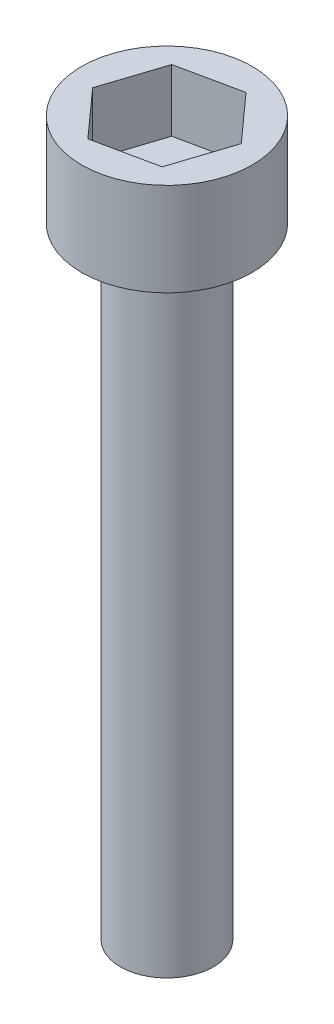
ISO-10303-21;
HEADER;
FILE_DESCRIPTION(('STEP AP214'),'2;1');
FILE_NAME('part.step','',(''),(''),'','','');
FILE_SCHEMA(('AUTOMOTIVE_DESIGN { 1 0 10303 214 1 1 1 1 }'));
ENDSEC;
DATA;
#1=APPLICATION_CONTEXT('core data for automotive mechanical design processes');
#2=APPLICATION_PROTOCOL_DEFINITION('international standard','automotive_design',2000,#1);
#3=PRODUCT_CONTEXT('',#1,'mechanical');
#4=PRODUCT('Part','Part','',(#3));
#5=PRODUCT_RELATED_PRODUCT_CATEGORY('part','',(#4));
#6=PRODUCT_DEFINITION_FORMATION('','',#4);
#7=PRODUCT_DEFINITION_CONTEXT('part definition',#1,'design');
#8=PRODUCT_DEFINITION('design','',#6,#7);
#9=PRODUCT_DEFINITION_SHAPE('','',#8);
#10=(LENGTH_UNIT() NAMED_UNIT(*) SI_UNIT(.MILLI.,.METRE.));
#11=(NAMED_UNIT(*) PLANE_ANGLE_UNIT() SI_UNIT($,.RADIAN.));
#12=(NAMED_UNIT(*) SI_UNIT($,.STERADIAN.) SOLID_ANGLE_UNIT());
#13=UNCERTAINTY_MEASURE_WITH_UNIT(LENGTH_MEASURE(1.E-05),#10,'distance_accuracy_value','');
#14=(GEOMETRIC_REPRESENTATION_CONTEXT(3) GLOBAL_UNCERTAINTY_ASSIGNED_CONTEXT((#13)) GLOBAL_UNIT_ASSIGNED_CONTEXT((#10,
#11,#12)) REPRESENTATION_CONTEXT('',''));
#15=CARTESIAN_POINT('',(0.,0.,0.));
#16=DIRECTION('',(0.,0.,1.));
#17=DIRECTION('',(1.,0.,0.));
#18=AXIS2_PLACEMENT_3D('',#15,#16,#17);
#19=CARTESIAN_POINT('',(0.,20.,0.));
#20=DIRECTION('',(0.,-1.,0.));
#21=DIRECTION('',(0.,0.,-1.));
#22=AXIS2_PLACEMENT_3D('',#19,#20,#21);
#23=CYLINDRICAL_SURFACE('',#22,1.5);
#24=CARTESIAN_POINT('',(0.,20.,0.));
#25=DIRECTION('',(0.,1.,0.));
#26=DIRECTION('',(0.,0.,1.));
#27=AXIS2_PLACEMENT_3D('',#24,#25,#26);
#28=CIRCLE('',#27,1.5);
#29=CARTESIAN_POINT('',(0.,20.,1.5));
#30=VERTEX_POINT('',#29);
#31=EDGE_CURVE('E11',#30,#30,#28,.T.);
#32=ORIENTED_EDGE('',*,*,#31,.F.);
#33=EDGE_LOOP('',(#32));
#34=FACE_BOUND('',#33,.T.);
#35=CARTESIAN_POINT('',(0.,0.,0.));
#36=DIRECTION('',(0.,1.,0.));
#37=DIRECTION('',(0.,0.,1.));
#38=AXIS2_PLACEMENT_3D('',#35,#36,#37);
#39=CIRCLE('',#38,1.5);
#40=CARTESIAN_POINT('',(0.,0.,1.5));
#41=VERTEX_POINT('',#40);
#42=EDGE_CURVE('E42',#41,#41,#39,.T.);
#43=ORIENTED_EDGE('',*,*,#42,.T.);
#44=EDGE_LOOP('',(#43));
#45=FACE_BOUND('',#44,.T.);
#46=ADVANCED_FACE('F39',(#34,#45),#23,.T.);
#47=CARTESIAN_POINT('',(0.,0.,0.));
#48=DIRECTION('',(0.,1.,0.));
#49=DIRECTION('',(0.,0.,1.));
#50=AXIS2_PLACEMENT_3D('',#47,#48,#49);
#51=PLANE('',#50);
#52=ORIENTED_EDGE('',*,*,#42,.F.);
#53=EDGE_LOOP('',(#52));
#54=FACE_BOUND('',#53,.T.);
#55=ADVANCED_FACE('F189',(#54),#51,.F.);
#56=CARTESIAN_POINT('',(0.,23.,0.));
#57=DIRECTION('',(0.,-1.,0.));
#58=DIRECTION('',(0.,0.,-1.));
#59=AXIS2_PLACEMENT_3D('',#56,#57,#58);
#60=CYLINDRICAL_SURFACE('',#59,2.75);
#61=CARTESIAN_POINT('',(0.,23.,0.));
#62=DIRECTION('',(0.,1.,0.));
#63=DIRECTION('',(0.,0.,1.));
#64=AXIS2_PLACEMENT_3D('',#61,#62,#63);
#65=CIRCLE('',#64,2.75);
#66=CARTESIAN_POINT('',(0.,23.,2.75));
#67=VERTEX_POINT('',#66);
#68=EDGE_CURVE('E163',#67,#67,#65,.T.);
#69=ORIENTED_EDGE('',*,*,#68,.F.);
#70=EDGE_LOOP('',(#69));
#71=FACE_BOUND('',#70,.T.);
#72=CARTESIAN_POINT('',(0.,20.,0.));
#73=DIRECTION('',(0.,1.,0.));
#74=DIRECTION('',(0.,0.,1.));
#75=AXIS2_PLACEMENT_3D('',#72,#73,#74);
#76=CIRCLE('',#75,2.75);
#77=CARTESIAN_POINT('',(0.,20.,2.75));
#78=VERTEX_POINT('',#77);
#79=EDGE_CURVE('E153',#78,#78,#76,.T.);
#80=ORIENTED_EDGE('',*,*,#79,.T.);
#81=EDGE_LOOP('',(#80));
#82=FACE_BOUND('',#81,.T.);
#83=ADVANCED_FACE('F171',(#71,#82),#60,.T.);
#84=CARTESIAN_POINT('',(0.,23.,0.));
#85=DIRECTION('',(0.,1.,0.));
#86=DIRECTION('',(0.,0.,1.));
#87=AXIS2_PLACEMENT_3D('',#84,#85,#86);
#88=PLANE('',#87);
#89=DIRECTION('',(0.310351345735064,0.,-0.950621923900577));
#90=VECTOR('',#89,1.);
#91=CARTESIAN_POINT('',(1.35002085906988,23.,1.50358804644409));
#92=LINE('',#91,#90);
#93=CARTESIAN_POINT('',(1.35002085906988,23.,1.50358804644409));
#94=VERTEX_POINT('',#93);
#95=CARTESIAN_POINT('',(1.97715587458214,23.,-0.417358336371365));
#96=VERTEX_POINT('',#95);
#97=EDGE_CURVE('E54',#94,#96,#92,.T.);
#98=ORIENTED_EDGE('',*,*,#97,.F.);
#99=DIRECTION('',(0.978438408359869,0.,-0.206538812445036));
#100=VECTOR('',#99,1.);
#101=CARTESIAN_POINT('',(-0.627135015512258,23.,1.92094638281546));
#102=LINE('',#101,#100);
#103=CARTESIAN_POINT('',(-0.627135015512258,23.,1.92094638281546));
#104=VERTEX_POINT('',#103);
#105=EDGE_CURVE('E147',#104,#94,#102,.T.);
#106=ORIENTED_EDGE('',*,*,#105,.F.);
#107=DIRECTION('',(0.668087062624805,0.,0.744083111455542));
#108=VECTOR('',#107,1.);
#109=CARTESIAN_POINT('',(-1.97715587458214,23.,0.417358336371365));
#110=LINE('',#109,#108);
#111=CARTESIAN_POINT('',(-1.97715587458214,23.,0.417358336371365));
#112=VERTEX_POINT('',#111);
#113=EDGE_CURVE('E144',#112,#104,#110,.T.);
#114=ORIENTED_EDGE('',*,*,#113,.F.);
#115=DIRECTION('',(-0.310351345735064,0.,0.950621923900577));
#116=VECTOR('',#115,1.);
#117=CARTESIAN_POINT('',(-1.35002085906988,23.,-1.50358804644409));
#118=LINE('',#117,#116);
#119=CARTESIAN_POINT('',(-1.35002085906988,23.,-1.50358804644409));
#120=VERTEX_POINT('',#119);
#121=EDGE_CURVE('E102',#120,#112,#118,.T.);
#122=ORIENTED_EDGE('',*,*,#121,.F.);
#123=DIRECTION('',(-0.978438408359869,0.,0.206538812445035));
#124=VECTOR('',#123,1.);
#125=CARTESIAN_POINT('',(0.627135015512258,23.,-1.92094638281546));
#126=LINE('',#125,#124);
#127=CARTESIAN_POINT('',(0.627135015512258,23.,-1.92094638281546));
#128=VERTEX_POINT('',#127);
#129=EDGE_CURVE('E138',#128,#120,#126,.T.);
#130=ORIENTED_EDGE('',*,*,#129,.F.);
#131=DIRECTION('',(-0.668087062624805,0.,-0.744083111455542));
#132=VECTOR('',#131,1.);
#133=CARTESIAN_POINT('',(1.97715587458214,23.,-0.417358336371365));
#134=LINE('',#133,#132);
#135=EDGE_CURVE('E134',#96,#128,#134,.T.);
#136=ORIENTED_EDGE('',*,*,#135,.F.);
#137=EDGE_LOOP('',(#98,#106,#114,#122,#130,#136));
#138=FACE_BOUND('',#137,.T.);
#139=ORIENTED_EDGE('',*,*,#68,.T.);
#140=EDGE_LOOP('',(#139));
#141=FACE_BOUND('',#140,.T.);
#142=ADVANCED_FACE('F176',(#138,#141),#88,.T.);
#143=CARTESIAN_POINT('',(0.,20.,0.));
#144=DIRECTION('',(0.,1.,0.));
#145=DIRECTION('',(0.,0.,1.));
#146=AXIS2_PLACEMENT_3D('',#143,#144,#145);
#147=PLANE('',#146);
#148=ORIENTED_EDGE('',*,*,#31,.T.);
#149=EDGE_LOOP('',(#148));
#150=FACE_BOUND('',#149,.T.);
#151=ORIENTED_EDGE('',*,*,#79,.F.);
#152=EDGE_LOOP('',(#151));
#153=FACE_BOUND('',#152,.T.);
#154=ADVANCED_FACE('F173',(#150,#153),#147,.F.);
#155=CARTESIAN_POINT('',(1.35002085906988,21.,1.50358804644409));
#156=DIRECTION('',(0.950621923900577,0.,0.310351345735064));
#157=DIRECTION('',(0.310351345735064,0.,-0.950621923900577));
#158=AXIS2_PLACEMENT_3D('',#155,#156,#157);
#159=PLANE('',#158);
#160=ORIENTED_EDGE('',*,*,#97,.T.);
#161=DIRECTION('',(0.,1.,0.));
#162=VECTOR('',#161,1.);
#163=CARTESIAN_POINT('',(1.97715587458214,21.,-0.417358336371365));
#164=LINE('',#163,#162);
#165=CARTESIAN_POINT('',(1.97715587458214,21.,-0.417358336371365));
#166=VERTEX_POINT('',#165);
#167=EDGE_CURVE('E84',#166,#96,#164,.T.);
#168=ORIENTED_EDGE('',*,*,#167,.F.);
#169=DIRECTION('',(0.310351345735064,0.,-0.950621923900577));
#170=VECTOR('',#169,1.);
#171=CARTESIAN_POINT('',(1.35002085906988,21.,1.50358804644409));
#172=LINE('',#171,#170);
#173=CARTESIAN_POINT('',(1.35002085906988,21.,1.50358804644409));
#174=VERTEX_POINT('',#173);
#175=EDGE_CURVE('E150',#174,#166,#172,.T.);
#176=ORIENTED_EDGE('',*,*,#175,.F.);
#177=DIRECTION('',(0.,1.,0.));
#178=VECTOR('',#177,1.);
#179=CARTESIAN_POINT('',(1.35002085906988,21.,1.50358804644409));
#180=LINE('',#179,#178);
#181=EDGE_CURVE('E62',#174,#94,#180,.T.);
#182=ORIENTED_EDGE('',*,*,#181,.T.);
#183=EDGE_LOOP('',(#160,#168,#176,#182));
#184=FACE_BOUND('',#183,.T.);
#185=ADVANCED_FACE('F175',(#184),#159,.F.);
#186=CARTESIAN_POINT('',(-0.627135015512258,21.,1.92094638281546));
#187=DIRECTION('',(0.206538812445036,0.,0.978438408359869));
#188=DIRECTION('',(0.97843840835987,0.,-0.206538812445036));
#189=AXIS2_PLACEMENT_3D('',#186,#187,#188);
#190=PLANE('',#189);
#191=ORIENTED_EDGE('',*,*,#105,.T.);
#192=ORIENTED_EDGE('',*,*,#181,.F.);
#193=DIRECTION('',(0.978438408359869,0.,-0.206538812445036));
#194=VECTOR('',#193,1.);
#195=CARTESIAN_POINT('',(-0.627135015512258,21.,1.92094638281546));
#196=LINE('',#195,#194);
#197=CARTESIAN_POINT('',(-0.627135015512258,21.,1.92094638281546));
#198=VERTEX_POINT('',#197);
#199=EDGE_CURVE('E116',#198,#174,#196,.T.);
#200=ORIENTED_EDGE('',*,*,#199,.F.);
#201=DIRECTION('',(0.,1.,0.));
#202=VECTOR('',#201,1.);
#203=CARTESIAN_POINT('',(-0.627135015512258,21.,1.92094638281546));
#204=LINE('',#203,#202);
#205=EDGE_CURVE('E107',#198,#104,#204,.T.);
#206=ORIENTED_EDGE('',*,*,#205,.T.);
#207=EDGE_LOOP('',(#191,#192,#200,#206));
#208=FACE_BOUND('',#207,.T.);
#209=ADVANCED_FACE('F183',(#208),#190,.F.);
#210=CARTESIAN_POINT('',(-1.97715587458214,21.,0.417358336371365));
#211=DIRECTION('',(-0.744083111455542,0.,0.668087062624805));
#212=DIRECTION('',(0.668087062624805,0.,0.744083111455542));
#213=AXIS2_PLACEMENT_3D('',#210,#211,#212);
#214=PLANE('',#213);
#215=ORIENTED_EDGE('',*,*,#113,.T.);
#216=ORIENTED_EDGE('',*,*,#205,.F.);
#217=DIRECTION('',(0.668087062624805,0.,0.744083111455542));
#218=VECTOR('',#217,1.);
#219=CARTESIAN_POINT('',(-1.97715587458214,21.,0.417358336371365));
#220=LINE('',#219,#218);
#221=CARTESIAN_POINT('',(-1.97715587458214,21.,0.417358336371365));
#222=VERTEX_POINT('',#221);
#223=EDGE_CURVE('E111',#222,#198,#220,.T.);
#224=ORIENTED_EDGE('',*,*,#223,.F.);
#225=DIRECTION('',(0.,1.,0.));
#226=VECTOR('',#225,1.);
#227=CARTESIAN_POINT('',(-1.97715587458214,21.,0.417358336371365));
#228=LINE('',#227,#226);
#229=EDGE_CURVE('E95',#222,#112,#228,.T.);
#230=ORIENTED_EDGE('',*,*,#229,.T.);
#231=EDGE_LOOP('',(#215,#216,#224,#230));
#232=FACE_BOUND('',#231,.T.);
#233=ADVANCED_FACE('F112',(#232),#214,.F.);
#234=CARTESIAN_POINT('',(-1.35002085906988,21.,-1.50358804644409));
#235=DIRECTION('',(-0.950621923900577,0.,-0.310351345735064));
#236=DIRECTION('',(-0.310351345735064,0.,0.950621923900577));
#237=AXIS2_PLACEMENT_3D('',#234,#235,#236);
#238=PLANE('',#237);
#239=ORIENTED_EDGE('',*,*,#121,.T.);
#240=ORIENTED_EDGE('',*,*,#229,.F.);
#241=DIRECTION('',(-0.310351345735064,0.,0.950621923900577));
#242=VECTOR('',#241,1.);
#243=CARTESIAN_POINT('',(-1.35002085906988,21.,-1.50358804644409));
#244=LINE('',#243,#242);
#245=CARTESIAN_POINT('',(-1.35002085906988,21.,-1.50358804644409));
#246=VERTEX_POINT('',#245);
#247=EDGE_CURVE('E99',#246,#222,#244,.T.);
#248=ORIENTED_EDGE('',*,*,#247,.F.);
#249=DIRECTION('',(0.,1.,0.));
#250=VECTOR('',#249,1.);
#251=CARTESIAN_POINT('',(-1.35002085906988,21.,-1.50358804644409));
#252=LINE('',#251,#250);
#253=EDGE_CURVE('E108',#246,#120,#252,.T.);
#254=ORIENTED_EDGE('',*,*,#253,.T.);
#255=EDGE_LOOP('',(#239,#240,#248,#254));
#256=FACE_BOUND('',#255,.T.);
#257=ADVANCED_FACE('F97',(#256),#238,.F.);
#258=CARTESIAN_POINT('',(0.627135015512258,21.,-1.92094638281546));
#259=DIRECTION('',(-0.206538812445035,0.,-0.97843840835987));
#260=DIRECTION('',(-0.97843840835987,0.,0.206538812445035));
#261=AXIS2_PLACEMENT_3D('',#258,#259,#260);
#262=PLANE('',#261);
#263=ORIENTED_EDGE('',*,*,#129,.T.);
#264=ORIENTED_EDGE('',*,*,#253,.F.);
#265=DIRECTION('',(-0.978438408359869,0.,0.206538812445035));
#266=VECTOR('',#265,1.);
#267=CARTESIAN_POINT('',(0.627135015512258,21.,-1.92094638281546));
#268=LINE('',#267,#266);
#269=CARTESIAN_POINT('',(0.627135015512258,21.,-1.92094638281546));
#270=VERTEX_POINT('',#269);
#271=EDGE_CURVE('E122',#270,#246,#268,.T.);
#272=ORIENTED_EDGE('',*,*,#271,.F.);
#273=DIRECTION('',(0.,1.,0.));
#274=VECTOR('',#273,1.);
#275=CARTESIAN_POINT('',(0.627135015512258,21.,-1.92094638281546));
#276=LINE('',#275,#274);
#277=EDGE_CURVE('E158',#270,#128,#276,.T.);
#278=ORIENTED_EDGE('',*,*,#277,.T.);
#279=EDGE_LOOP('',(#263,#264,#272,#278));
#280=FACE_BOUND('',#279,.T.);
#281=ADVANCED_FACE('F245',(#280),#262,.F.);
#282=CARTESIAN_POINT('',(1.97715587458214,21.,-0.417358336371365));
#283=DIRECTION('',(0.744083111455542,0.,-0.668087062624805));
#284=DIRECTION('',(-0.668087062624805,0.,-0.744083111455542));
#285=AXIS2_PLACEMENT_3D('',#282,#283,#284);
#286=PLANE('',#285);
#287=ORIENTED_EDGE('',*,*,#135,.T.);
#288=ORIENTED_EDGE('',*,*,#277,.F.);
#289=DIRECTION('',(-0.668087062624805,0.,-0.744083111455542));
#290=VECTOR('',#289,1.);
#291=CARTESIAN_POINT('',(1.97715587458214,21.,-0.417358336371365));
#292=LINE('',#291,#290);
#293=EDGE_CURVE('E126',#166,#270,#292,.T.);
#294=ORIENTED_EDGE('',*,*,#293,.F.);
#295=ORIENTED_EDGE('',*,*,#167,.T.);
#296=EDGE_LOOP('',(#287,#288,#294,#295));
#297=FACE_BOUND('',#296,.T.);
#298=ADVANCED_FACE('F254',(#297),#286,.F.);
#299=CARTESIAN_POINT('',(0.,21.,0.));
#300=DIRECTION('',(0.,1.,0.));
#301=DIRECTION('',(0.,0.,1.));
#302=AXIS2_PLACEMENT_3D('',#299,#300,#301);
#303=PLANE('',#302);
#304=ORIENTED_EDGE('',*,*,#175,.T.);
#305=ORIENTED_EDGE('',*,*,#293,.T.);
#306=ORIENTED_EDGE('',*,*,#271,.T.);
#307=ORIENTED_EDGE('',*,*,#247,.T.);
#308=ORIENTED_EDGE('',*,*,#223,.T.);
#309=ORIENTED_EDGE('',*,*,#199,.T.);
#310=EDGE_LOOP('',(#304,#305,#306,#307,#308,#309));
#311=FACE_BOUND('',#310,.T.);
#312=ADVANCED_FACE('F119',(#311),#303,.T.);
#313=CLOSED_SHELL('',(#46,#55,#83,#142,#154,#185,#209,#233,#257,#281,#298,#312));
#314=MANIFOLD_SOLID_BREP('B2',#313);
#315=ADVANCED_BREP_SHAPE_REPRESENTATION('',(#18,#314),#14);
#316=SHAPE_DEFINITION_REPRESENTATION(#9,#315);
ENDSEC;
END-ISO-10303-21;
